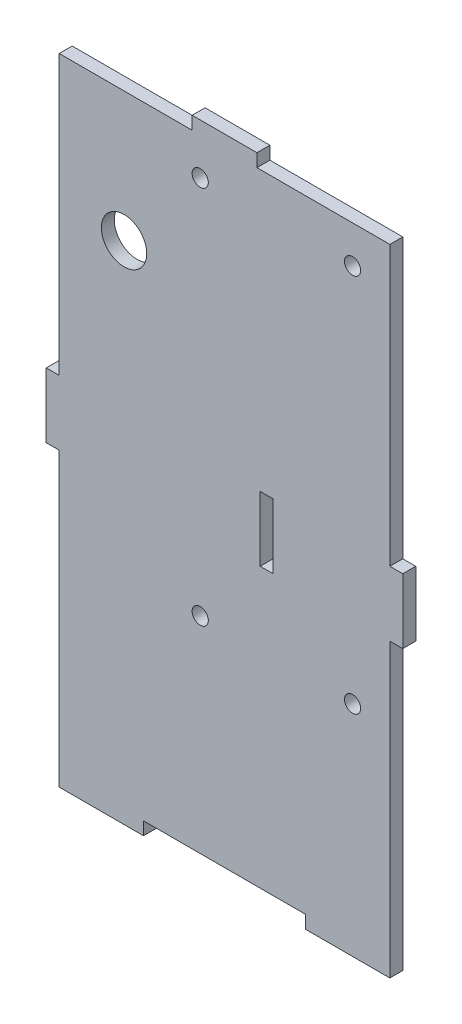
ISO-10303-21;
HEADER;
FILE_DESCRIPTION(('STEP AP214'),'2;1');
FILE_NAME('part.step','',(''),(''),'','','');
FILE_SCHEMA(('AUTOMOTIVE_DESIGN { 1 0 10303 214 1 1 1 1 }'));
ENDSEC;
DATA;
#1=APPLICATION_CONTEXT('core data for automotive mechanical design processes');
#2=APPLICATION_PROTOCOL_DEFINITION('international standard','automotive_design',2000,#1);
#3=PRODUCT_CONTEXT('',#1,'mechanical');
#4=PRODUCT('Part','Part','',(#3));
#5=PRODUCT_RELATED_PRODUCT_CATEGORY('part','',(#4));
#6=PRODUCT_DEFINITION_FORMATION('','',#4);
#7=PRODUCT_DEFINITION_CONTEXT('part definition',#1,'design');
#8=PRODUCT_DEFINITION('design','',#6,#7);
#9=PRODUCT_DEFINITION_SHAPE('','',#8);
#10=(LENGTH_UNIT() NAMED_UNIT(*) SI_UNIT(.MILLI.,.METRE.));
#11=(NAMED_UNIT(*) PLANE_ANGLE_UNIT() SI_UNIT($,.RADIAN.));
#12=(NAMED_UNIT(*) SI_UNIT($,.STERADIAN.) SOLID_ANGLE_UNIT());
#13=UNCERTAINTY_MEASURE_WITH_UNIT(LENGTH_MEASURE(1.E-05),#10,'distance_accuracy_value','');
#14=(GEOMETRIC_REPRESENTATION_CONTEXT(3) GLOBAL_UNCERTAINTY_ASSIGNED_CONTEXT((#13)) GLOBAL_UNIT_ASSIGNED_CONTEXT((#10,
#11,#12)) REPRESENTATION_CONTEXT('',''));
#15=CARTESIAN_POINT('',(0.,0.,0.));
#16=DIRECTION('',(0.,0.,1.));
#17=DIRECTION('',(1.,0.,0.));
#18=AXIS2_PLACEMENT_3D('',#15,#16,#17);
#19=CARTESIAN_POINT('',(0.,0.,2.));
#20=DIRECTION('',(0.,0.,-1.));
#21=DIRECTION('',(-1.,0.,0.));
#22=AXIS2_PLACEMENT_3D('',#19,#20,#21);
#23=PLANE('',#22);
#24=DIRECTION('',(-1.,0.,0.));
#25=VECTOR('',#24,1.);
#26=CARTESIAN_POINT('',(22.5,100.,2.));
#27=LINE('',#26,#25);
#28=CARTESIAN_POINT('',(32.5,100.,2.));
#29=VERTEX_POINT('',#28);
#30=CARTESIAN_POINT('',(22.5,100.,2.));
#31=VERTEX_POINT('',#30);
#32=EDGE_CURVE('E232',#29,#31,#27,.T.);
#33=ORIENTED_EDGE('',*,*,#32,.T.);
#34=DIRECTION('',(0.,-1.,0.));
#35=VECTOR('',#34,1.);
#36=CARTESIAN_POINT('',(22.5,100.,2.));
#37=LINE('',#36,#35);
#38=CARTESIAN_POINT('',(22.5,98.,2.));
#39=VERTEX_POINT('',#38);
#40=EDGE_CURVE('E235',#31,#39,#37,.T.);
#41=ORIENTED_EDGE('',*,*,#40,.T.);
#42=DIRECTION('',(-1.,0.,0.));
#43=VECTOR('',#42,1.);
#44=CARTESIAN_POINT('',(22.5,98.,2.));
#45=LINE('',#44,#43);
#46=CARTESIAN_POINT('',(1.99999999999999,98.,2.));
#47=VERTEX_POINT('',#46);
#48=EDGE_CURVE('E238',#39,#47,#45,.T.);
#49=ORIENTED_EDGE('',*,*,#48,.T.);
#50=DIRECTION('',(0.,-1.,0.));
#51=VECTOR('',#50,1.);
#52=CARTESIAN_POINT('',(1.99999999999999,98.,2.));
#53=LINE('',#52,#51);
#54=CARTESIAN_POINT('',(2.,55.,2.));
#55=VERTEX_POINT('',#54);
#56=EDGE_CURVE('E240',#47,#55,#53,.T.);
#57=ORIENTED_EDGE('',*,*,#56,.T.);
#58=DIRECTION('',(-1.,0.,0.));
#59=VECTOR('',#58,1.);
#60=CARTESIAN_POINT('',(2.,55.,2.));
#61=LINE('',#60,#59);
#62=CARTESIAN_POINT('',(0.,55.,2.));
#63=VERTEX_POINT('',#62);
#64=EDGE_CURVE('E242',#55,#63,#61,.T.);
#65=ORIENTED_EDGE('',*,*,#64,.T.);
#66=DIRECTION('',(0.,-1.,0.));
#67=VECTOR('',#66,1.);
#68=CARTESIAN_POINT('',(0.,55.,2.));
#69=LINE('',#68,#67);
#70=CARTESIAN_POINT('',(0.,45.,2.));
#71=VERTEX_POINT('',#70);
#72=EDGE_CURVE('E244',#63,#71,#69,.T.);
#73=ORIENTED_EDGE('',*,*,#72,.T.);
#74=DIRECTION('',(1.,0.,0.));
#75=VECTOR('',#74,1.);
#76=CARTESIAN_POINT('',(0.,45.,2.));
#77=LINE('',#76,#75);
#78=CARTESIAN_POINT('',(2.,45.,2.));
#79=VERTEX_POINT('',#78);
#80=EDGE_CURVE('E246',#71,#79,#77,.T.);
#81=ORIENTED_EDGE('',*,*,#80,.T.);
#82=DIRECTION('',(0.,-1.,0.));
#83=VECTOR('',#82,1.);
#84=CARTESIAN_POINT('',(2.,45.,2.));
#85=LINE('',#84,#83);
#86=CARTESIAN_POINT('',(2.00000000000001,0.,2.));
#87=VERTEX_POINT('',#86);
#88=EDGE_CURVE('E248',#79,#87,#85,.T.);
#89=ORIENTED_EDGE('',*,*,#88,.T.);
#90=DIRECTION('',(1.,0.,0.));
#91=VECTOR('',#90,1.);
#92=CARTESIAN_POINT('',(15.,0.,2.));
#93=LINE('',#92,#91);
#94=CARTESIAN_POINT('',(15.,0.,2.));
#95=VERTEX_POINT('',#94);
#96=EDGE_CURVE('E250',#87,#95,#93,.T.);
#97=ORIENTED_EDGE('',*,*,#96,.T.);
#98=DIRECTION('',(0.,1.,0.));
#99=VECTOR('',#98,1.);
#100=CARTESIAN_POINT('',(15.,2.,2.));
#101=LINE('',#100,#99);
#102=CARTESIAN_POINT('',(15.,2.,2.));
#103=VERTEX_POINT('',#102);
#104=EDGE_CURVE('E252',#95,#103,#101,.T.);
#105=ORIENTED_EDGE('',*,*,#104,.T.);
#106=DIRECTION('',(1.,0.,0.));
#107=VECTOR('',#106,1.);
#108=CARTESIAN_POINT('',(40.,2.,2.));
#109=LINE('',#108,#107);
#110=CARTESIAN_POINT('',(40.,2.,2.));
#111=VERTEX_POINT('',#110);
#112=EDGE_CURVE('E254',#103,#111,#109,.T.);
#113=ORIENTED_EDGE('',*,*,#112,.T.);
#114=DIRECTION('',(0.,-1.,0.));
#115=VECTOR('',#114,1.);
#116=CARTESIAN_POINT('',(40.,0.,2.));
#117=LINE('',#116,#115);
#118=CARTESIAN_POINT('',(40.,0.,2.));
#119=VERTEX_POINT('',#118);
#120=EDGE_CURVE('E256',#111,#119,#117,.T.);
#121=ORIENTED_EDGE('',*,*,#120,.T.);
#122=DIRECTION('',(1.,0.,0.));
#123=VECTOR('',#122,1.);
#124=CARTESIAN_POINT('',(53.,0.,2.));
#125=LINE('',#124,#123);
#126=CARTESIAN_POINT('',(53.,0.,2.));
#127=VERTEX_POINT('',#126);
#128=EDGE_CURVE('E258',#119,#127,#125,.T.);
#129=ORIENTED_EDGE('',*,*,#128,.T.);
#130=DIRECTION('',(0.,1.,0.));
#131=VECTOR('',#130,1.);
#132=CARTESIAN_POINT('',(53.,45.,2.));
#133=LINE('',#132,#131);
#134=CARTESIAN_POINT('',(53.,45.,2.));
#135=VERTEX_POINT('',#134);
#136=EDGE_CURVE('E260',#127,#135,#133,.T.);
#137=ORIENTED_EDGE('',*,*,#136,.T.);
#138=DIRECTION('',(1.,0.,0.));
#139=VECTOR('',#138,1.);
#140=CARTESIAN_POINT('',(55.,45.,2.));
#141=LINE('',#140,#139);
#142=CARTESIAN_POINT('',(55.,45.,2.));
#143=VERTEX_POINT('',#142);
#144=EDGE_CURVE('E262',#135,#143,#141,.T.);
#145=ORIENTED_EDGE('',*,*,#144,.T.);
#146=DIRECTION('',(0.,1.,0.));
#147=VECTOR('',#146,1.);
#148=CARTESIAN_POINT('',(55.,55.,2.));
#149=LINE('',#148,#147);
#150=CARTESIAN_POINT('',(55.,55.,2.));
#151=VERTEX_POINT('',#150);
#152=EDGE_CURVE('E264',#143,#151,#149,.T.);
#153=ORIENTED_EDGE('',*,*,#152,.T.);
#154=DIRECTION('',(-1.,0.,0.));
#155=VECTOR('',#154,1.);
#156=CARTESIAN_POINT('',(53.,55.,2.));
#157=LINE('',#156,#155);
#158=CARTESIAN_POINT('',(53.,55.,2.));
#159=VERTEX_POINT('',#158);
#160=EDGE_CURVE('E266',#151,#159,#157,.T.);
#161=ORIENTED_EDGE('',*,*,#160,.T.);
#162=DIRECTION('',(0.,1.,0.));
#163=VECTOR('',#162,1.);
#164=CARTESIAN_POINT('',(53.,98.,2.));
#165=LINE('',#164,#163);
#166=CARTESIAN_POINT('',(53.,98.,2.));
#167=VERTEX_POINT('',#166);
#168=EDGE_CURVE('E268',#159,#167,#165,.T.);
#169=ORIENTED_EDGE('',*,*,#168,.T.);
#170=DIRECTION('',(-1.,0.,0.));
#171=VECTOR('',#170,1.);
#172=CARTESIAN_POINT('',(32.5,98.,2.));
#173=LINE('',#172,#171);
#174=CARTESIAN_POINT('',(32.5,98.,2.));
#175=VERTEX_POINT('',#174);
#176=EDGE_CURVE('E270',#167,#175,#173,.T.);
#177=ORIENTED_EDGE('',*,*,#176,.T.);
#178=DIRECTION('',(0.,1.,0.));
#179=VECTOR('',#178,1.);
#180=CARTESIAN_POINT('',(32.5,100.,2.));
#181=LINE('',#180,#179);
#182=EDGE_CURVE('E272',#175,#29,#181,.T.);
#183=ORIENTED_EDGE('',*,*,#182,.T.);
#184=EDGE_LOOP('',(#33,#41,#49,#57,#65,#73,#81,#89,#97,#105,#113,#121,#129,#137,#145,#153,#161,
#169,#177,#183));
#185=FACE_BOUND('',#184,.T.);
#186=DIRECTION('',(0.,1.,0.));
#187=VECTOR('',#186,1.);
#188=CARTESIAN_POINT('',(35.,55.,2.));
#189=LINE('',#188,#187);
#190=CARTESIAN_POINT('',(35.,45.,2.));
#191=VERTEX_POINT('',#190);
#192=CARTESIAN_POINT('',(35.,55.,2.));
#193=VERTEX_POINT('',#192);
#194=EDGE_CURVE('E193',#191,#193,#189,.T.);
#195=ORIENTED_EDGE('',*,*,#194,.F.);
#196=DIRECTION('',(1.,0.,0.));
#197=VECTOR('',#196,1.);
#198=CARTESIAN_POINT('',(35.,45.,2.));
#199=LINE('',#198,#197);
#200=CARTESIAN_POINT('',(33.,45.,2.));
#201=VERTEX_POINT('',#200);
#202=EDGE_CURVE('E216',#201,#191,#199,.T.);
#203=ORIENTED_EDGE('',*,*,#202,.F.);
#204=DIRECTION('',(0.,-1.,0.));
#205=VECTOR('',#204,1.);
#206=CARTESIAN_POINT('',(33.,55.,2.));
#207=LINE('',#206,#205);
#208=CARTESIAN_POINT('',(33.,55.,2.));
#209=VERTEX_POINT('',#208);
#210=EDGE_CURVE('E214',#209,#201,#207,.T.);
#211=ORIENTED_EDGE('',*,*,#210,.F.);
#212=DIRECTION('',(-1.,0.,0.));
#213=VECTOR('',#212,1.);
#214=CARTESIAN_POINT('',(35.,55.,2.));
#215=LINE('',#214,#213);
#216=EDGE_CURVE('E201',#193,#209,#215,.T.);
#217=ORIENTED_EDGE('',*,*,#216,.F.);
#218=EDGE_LOOP('',(#195,#203,#211,#217));
#219=FACE_BOUND('',#218,.T.);
#220=CARTESIAN_POINT('',(47.25,92.25,2.));
#221=DIRECTION('',(0.,0.,1.));
#222=DIRECTION('',(1.,0.,0.));
#223=AXIS2_PLACEMENT_3D('',#220,#221,#222);
#224=CIRCLE('',#223,1.25);
#225=CARTESIAN_POINT('',(48.5,92.25,2.));
#226=VERTEX_POINT('',#225);
#227=EDGE_CURVE('E222',#226,#226,#224,.T.);
#228=ORIENTED_EDGE('',*,*,#227,.F.);
#229=EDGE_LOOP('',(#228));
#230=FACE_BOUND('',#229,.T.);
#231=CARTESIAN_POINT('',(23.75,92.25,2.));
#232=DIRECTION('',(0.,0.,1.));
#233=DIRECTION('',(-1.,0.,0.));
#234=AXIS2_PLACEMENT_3D('',#231,#232,#233);
#235=CIRCLE('',#234,1.25);
#236=CARTESIAN_POINT('',(22.5,92.25,2.));
#237=VERTEX_POINT('',#236);
#238=EDGE_CURVE('E752',#237,#237,#235,.T.);
#239=ORIENTED_EDGE('',*,*,#238,.F.);
#240=EDGE_LOOP('',(#239));
#241=FACE_BOUND('',#240,.T.);
#242=CARTESIAN_POINT('',(47.25,33.75,2.));
#243=DIRECTION('',(0.,0.,1.));
#244=DIRECTION('',(-1.,0.,0.));
#245=AXIS2_PLACEMENT_3D('',#242,#243,#244);
#246=CIRCLE('',#245,1.25);
#247=CARTESIAN_POINT('',(46.,33.75,2.));
#248=VERTEX_POINT('',#247);
#249=EDGE_CURVE('E746',#248,#248,#246,.T.);
#250=ORIENTED_EDGE('',*,*,#249,.F.);
#251=EDGE_LOOP('',(#250));
#252=FACE_BOUND('',#251,.T.);
#253=CARTESIAN_POINT('',(23.75,33.75,2.));
#254=DIRECTION('',(0.,0.,1.));
#255=DIRECTION('',(1.,0.,0.));
#256=AXIS2_PLACEMENT_3D('',#253,#254,#255);
#257=CIRCLE('',#256,1.25);
#258=CARTESIAN_POINT('',(25.,33.75,2.));
#259=VERTEX_POINT('',#258);
#260=EDGE_CURVE('E740',#259,#259,#257,.T.);
#261=ORIENTED_EDGE('',*,*,#260,.F.);
#262=EDGE_LOOP('',(#261));
#263=FACE_BOUND('',#262,.T.);
#264=CARTESIAN_POINT('',(12.,78.,2.));
#265=DIRECTION('',(0.,0.,1.));
#266=DIRECTION('',(1.,0.,0.));
#267=AXIS2_PLACEMENT_3D('',#264,#265,#266);
#268=CIRCLE('',#267,3.5);
#269=CARTESIAN_POINT('',(15.5,78.,2.));
#270=VERTEX_POINT('',#269);
#271=EDGE_CURVE('E731',#270,#270,#268,.T.);
#272=ORIENTED_EDGE('',*,*,#271,.F.);
#273=EDGE_LOOP('',(#272));
#274=FACE_BOUND('',#273,.T.);
#275=ADVANCED_FACE('F32',(#185,#219,#230,#241,#252,#263,#274),#23,.F.);
#276=CARTESIAN_POINT('',(0.,0.,0.));
#277=DIRECTION('',(0.,0.,-1.));
#278=DIRECTION('',(-1.,0.,0.));
#279=AXIS2_PLACEMENT_3D('',#276,#277,#278);
#280=PLANE('',#279);
#281=CARTESIAN_POINT('',(23.75,33.75,0.));
#282=DIRECTION('',(0.,0.,1.));
#283=DIRECTION('',(1.,0.,0.));
#284=AXIS2_PLACEMENT_3D('',#281,#282,#283);
#285=CIRCLE('',#284,1.25);
#286=CARTESIAN_POINT('',(25.,33.75,0.));
#287=VERTEX_POINT('',#286);
#288=EDGE_CURVE('E737',#287,#287,#285,.T.);
#289=ORIENTED_EDGE('',*,*,#288,.T.);
#290=EDGE_LOOP('',(#289));
#291=FACE_BOUND('',#290,.T.);
#292=CARTESIAN_POINT('',(23.75,92.25,0.));
#293=DIRECTION('',(0.,0.,1.));
#294=DIRECTION('',(-1.,0.,0.));
#295=AXIS2_PLACEMENT_3D('',#292,#293,#294);
#296=CIRCLE('',#295,1.25);
#297=CARTESIAN_POINT('',(22.5,92.25,0.));
#298=VERTEX_POINT('',#297);
#299=EDGE_CURVE('E749',#298,#298,#296,.T.);
#300=ORIENTED_EDGE('',*,*,#299,.T.);
#301=EDGE_LOOP('',(#300));
#302=FACE_BOUND('',#301,.T.);
#303=DIRECTION('',(1.,0.,0.));
#304=VECTOR('',#303,1.);
#305=CARTESIAN_POINT('',(35.,45.,0.));
#306=LINE('',#305,#304);
#307=CARTESIAN_POINT('',(33.,45.,0.));
#308=VERTEX_POINT('',#307);
#309=CARTESIAN_POINT('',(35.,45.,0.));
#310=VERTEX_POINT('',#309);
#311=EDGE_CURVE('E202',#308,#310,#306,.T.);
#312=ORIENTED_EDGE('',*,*,#311,.T.);
#313=DIRECTION('',(0.,1.,0.));
#314=VECTOR('',#313,1.);
#315=CARTESIAN_POINT('',(35.,55.,0.));
#316=LINE('',#315,#314);
#317=CARTESIAN_POINT('',(35.,55.,0.));
#318=VERTEX_POINT('',#317);
#319=EDGE_CURVE('E55',#310,#318,#316,.T.);
#320=ORIENTED_EDGE('',*,*,#319,.T.);
#321=DIRECTION('',(-1.,0.,0.));
#322=VECTOR('',#321,1.);
#323=CARTESIAN_POINT('',(35.,55.,0.));
#324=LINE('',#323,#322);
#325=CARTESIAN_POINT('',(33.,55.,0.));
#326=VERTEX_POINT('',#325);
#327=EDGE_CURVE('E208',#318,#326,#324,.T.);
#328=ORIENTED_EDGE('',*,*,#327,.T.);
#329=DIRECTION('',(0.,-1.,0.));
#330=VECTOR('',#329,1.);
#331=CARTESIAN_POINT('',(33.,55.,0.));
#332=LINE('',#331,#330);
#333=EDGE_CURVE('E224',#326,#308,#332,.T.);
#334=ORIENTED_EDGE('',*,*,#333,.T.);
#335=EDGE_LOOP('',(#312,#320,#328,#334));
#336=FACE_BOUND('',#335,.T.);
#337=DIRECTION('',(-1.,0.,0.));
#338=VECTOR('',#337,1.);
#339=CARTESIAN_POINT('',(22.5,100.,0.));
#340=LINE('',#339,#338);
#341=CARTESIAN_POINT('',(32.5,100.,0.));
#342=VERTEX_POINT('',#341);
#343=CARTESIAN_POINT('',(22.5,100.,0.));
#344=VERTEX_POINT('',#343);
#345=EDGE_CURVE('E209',#342,#344,#340,.T.);
#346=ORIENTED_EDGE('',*,*,#345,.F.);
#347=DIRECTION('',(0.,1.,0.));
#348=VECTOR('',#347,1.);
#349=CARTESIAN_POINT('',(32.5,100.,0.));
#350=LINE('',#349,#348);
#351=CARTESIAN_POINT('',(32.5,98.,0.));
#352=VERTEX_POINT('',#351);
#353=EDGE_CURVE('E236',#352,#342,#350,.T.);
#354=ORIENTED_EDGE('',*,*,#353,.F.);
#355=DIRECTION('',(-1.,0.,0.));
#356=VECTOR('',#355,1.);
#357=CARTESIAN_POINT('',(32.5,98.,0.));
#358=LINE('',#357,#356);
#359=CARTESIAN_POINT('',(53.,98.,0.));
#360=VERTEX_POINT('',#359);
#361=EDGE_CURVE('E311',#360,#352,#358,.T.);
#362=ORIENTED_EDGE('',*,*,#361,.F.);
#363=DIRECTION('',(0.,1.,0.));
#364=VECTOR('',#363,1.);
#365=CARTESIAN_POINT('',(53.,98.,0.));
#366=LINE('',#365,#364);
#367=CARTESIAN_POINT('',(53.,55.,0.));
#368=VERTEX_POINT('',#367);
#369=EDGE_CURVE('E309',#368,#360,#366,.T.);
#370=ORIENTED_EDGE('',*,*,#369,.F.);
#371=DIRECTION('',(-1.,0.,0.));
#372=VECTOR('',#371,1.);
#373=CARTESIAN_POINT('',(53.,55.,0.));
#374=LINE('',#373,#372);
#375=CARTESIAN_POINT('',(55.,55.,0.));
#376=VERTEX_POINT('',#375);
#377=EDGE_CURVE('E307',#376,#368,#374,.T.);
#378=ORIENTED_EDGE('',*,*,#377,.F.);
#379=DIRECTION('',(0.,1.,0.));
#380=VECTOR('',#379,1.);
#381=CARTESIAN_POINT('',(55.,55.,0.));
#382=LINE('',#381,#380);
#383=CARTESIAN_POINT('',(55.,45.,0.));
#384=VERTEX_POINT('',#383);
#385=EDGE_CURVE('E305',#384,#376,#382,.T.);
#386=ORIENTED_EDGE('',*,*,#385,.F.);
#387=DIRECTION('',(1.,0.,0.));
#388=VECTOR('',#387,1.);
#389=CARTESIAN_POINT('',(55.,45.,0.));
#390=LINE('',#389,#388);
#391=CARTESIAN_POINT('',(53.,45.,0.));
#392=VERTEX_POINT('',#391);
#393=EDGE_CURVE('E303',#392,#384,#390,.T.);
#394=ORIENTED_EDGE('',*,*,#393,.F.);
#395=DIRECTION('',(0.,1.,0.));
#396=VECTOR('',#395,1.);
#397=CARTESIAN_POINT('',(53.,45.,0.));
#398=LINE('',#397,#396);
#399=CARTESIAN_POINT('',(53.,0.,0.));
#400=VERTEX_POINT('',#399);
#401=EDGE_CURVE('E301',#400,#392,#398,.T.);
#402=ORIENTED_EDGE('',*,*,#401,.F.);
#403=DIRECTION('',(1.,0.,0.));
#404=VECTOR('',#403,1.);
#405=CARTESIAN_POINT('',(53.,0.,0.));
#406=LINE('',#405,#404);
#407=CARTESIAN_POINT('',(40.,0.,0.));
#408=VERTEX_POINT('',#407);
#409=EDGE_CURVE('E299',#408,#400,#406,.T.);
#410=ORIENTED_EDGE('',*,*,#409,.F.);
#411=DIRECTION('',(0.,-1.,0.));
#412=VECTOR('',#411,1.);
#413=CARTESIAN_POINT('',(40.,0.,0.));
#414=LINE('',#413,#412);
#415=CARTESIAN_POINT('',(40.,2.,0.));
#416=VERTEX_POINT('',#415);
#417=EDGE_CURVE('E297',#416,#408,#414,.T.);
#418=ORIENTED_EDGE('',*,*,#417,.F.);
#419=DIRECTION('',(1.,0.,0.));
#420=VECTOR('',#419,1.);
#421=CARTESIAN_POINT('',(40.,2.,0.));
#422=LINE('',#421,#420);
#423=CARTESIAN_POINT('',(15.,2.,0.));
#424=VERTEX_POINT('',#423);
#425=EDGE_CURVE('E295',#424,#416,#422,.T.);
#426=ORIENTED_EDGE('',*,*,#425,.F.);
#427=DIRECTION('',(0.,1.,0.));
#428=VECTOR('',#427,1.);
#429=CARTESIAN_POINT('',(15.,2.,0.));
#430=LINE('',#429,#428);
#431=CARTESIAN_POINT('',(15.,0.,0.));
#432=VERTEX_POINT('',#431);
#433=EDGE_CURVE('E293',#432,#424,#430,.T.);
#434=ORIENTED_EDGE('',*,*,#433,.F.);
#435=DIRECTION('',(1.,0.,0.));
#436=VECTOR('',#435,1.);
#437=CARTESIAN_POINT('',(15.,0.,0.));
#438=LINE('',#437,#436);
#439=CARTESIAN_POINT('',(2.00000000000001,0.,0.));
#440=VERTEX_POINT('',#439);
#441=EDGE_CURVE('E291',#440,#432,#438,.T.);
#442=ORIENTED_EDGE('',*,*,#441,.F.);
#443=DIRECTION('',(0.,-1.,0.));
#444=VECTOR('',#443,1.);
#445=CARTESIAN_POINT('',(2.,45.,0.));
#446=LINE('',#445,#444);
#447=CARTESIAN_POINT('',(2.,45.,0.));
#448=VERTEX_POINT('',#447);
#449=EDGE_CURVE('E289',#448,#440,#446,.T.);
#450=ORIENTED_EDGE('',*,*,#449,.F.);
#451=DIRECTION('',(1.,0.,0.));
#452=VECTOR('',#451,1.);
#453=CARTESIAN_POINT('',(0.,45.,0.));
#454=LINE('',#453,#452);
#455=CARTESIAN_POINT('',(0.,45.,0.));
#456=VERTEX_POINT('',#455);
#457=EDGE_CURVE('E287',#456,#448,#454,.T.);
#458=ORIENTED_EDGE('',*,*,#457,.F.);
#459=DIRECTION('',(0.,-1.,0.));
#460=VECTOR('',#459,1.);
#461=CARTESIAN_POINT('',(0.,55.,0.));
#462=LINE('',#461,#460);
#463=CARTESIAN_POINT('',(0.,55.,0.));
#464=VERTEX_POINT('',#463);
#465=EDGE_CURVE('E285',#464,#456,#462,.T.);
#466=ORIENTED_EDGE('',*,*,#465,.F.);
#467=DIRECTION('',(-1.,0.,0.));
#468=VECTOR('',#467,1.);
#469=CARTESIAN_POINT('',(2.,55.,0.));
#470=LINE('',#469,#468);
#471=CARTESIAN_POINT('',(2.,55.,0.));
#472=VERTEX_POINT('',#471);
#473=EDGE_CURVE('E283',#472,#464,#470,.T.);
#474=ORIENTED_EDGE('',*,*,#473,.F.);
#475=DIRECTION('',(0.,-1.,0.));
#476=VECTOR('',#475,1.);
#477=CARTESIAN_POINT('',(1.99999999999999,98.,0.));
#478=LINE('',#477,#476);
#479=CARTESIAN_POINT('',(1.99999999999999,98.,0.));
#480=VERTEX_POINT('',#479);
#481=EDGE_CURVE('E281',#480,#472,#478,.T.);
#482=ORIENTED_EDGE('',*,*,#481,.F.);
#483=DIRECTION('',(-1.,0.,0.));
#484=VECTOR('',#483,1.);
#485=CARTESIAN_POINT('',(22.5,98.,0.));
#486=LINE('',#485,#484);
#487=CARTESIAN_POINT('',(22.5,98.,0.));
#488=VERTEX_POINT('',#487);
#489=EDGE_CURVE('E279',#488,#480,#486,.T.);
#490=ORIENTED_EDGE('',*,*,#489,.F.);
#491=DIRECTION('',(0.,-1.,0.));
#492=VECTOR('',#491,1.);
#493=CARTESIAN_POINT('',(22.5,100.,0.));
#494=LINE('',#493,#492);
#495=EDGE_CURVE('E277',#344,#488,#494,.T.);
#496=ORIENTED_EDGE('',*,*,#495,.F.);
#497=EDGE_LOOP('',(#346,#354,#362,#370,#378,#386,#394,#402,#410,#418,#426,#434,#442,#450,#458,
#466,#474,#482,#490,#496));
#498=FACE_BOUND('',#497,.T.);
#499=CARTESIAN_POINT('',(47.25,92.25,0.));
#500=DIRECTION('',(0.,0.,1.));
#501=DIRECTION('',(1.,0.,0.));
#502=AXIS2_PLACEMENT_3D('',#499,#500,#501);
#503=CIRCLE('',#502,1.25);
#504=CARTESIAN_POINT('',(48.5,92.25,0.));
#505=VERTEX_POINT('',#504);
#506=EDGE_CURVE('E755',#505,#505,#503,.T.);
#507=ORIENTED_EDGE('',*,*,#506,.T.);
#508=EDGE_LOOP('',(#507));
#509=FACE_BOUND('',#508,.T.);
#510=CARTESIAN_POINT('',(47.25,33.75,0.));
#511=DIRECTION('',(0.,0.,1.));
#512=DIRECTION('',(-1.,0.,0.));
#513=AXIS2_PLACEMENT_3D('',#510,#511,#512);
#514=CIRCLE('',#513,1.25);
#515=CARTESIAN_POINT('',(46.,33.75,0.));
#516=VERTEX_POINT('',#515);
#517=EDGE_CURVE('E743',#516,#516,#514,.T.);
#518=ORIENTED_EDGE('',*,*,#517,.T.);
#519=EDGE_LOOP('',(#518));
#520=FACE_BOUND('',#519,.T.);
#521=CARTESIAN_POINT('',(12.,78.,0.));
#522=DIRECTION('',(0.,0.,1.));
#523=DIRECTION('',(1.,0.,0.));
#524=AXIS2_PLACEMENT_3D('',#521,#522,#523);
#525=CIRCLE('',#524,3.5);
#526=CARTESIAN_POINT('',(15.5,78.,0.));
#527=VERTEX_POINT('',#526);
#528=EDGE_CURVE('E734',#527,#527,#525,.T.);
#529=ORIENTED_EDGE('',*,*,#528,.T.);
#530=EDGE_LOOP('',(#529));
#531=FACE_BOUND('',#530,.T.);
#532=ADVANCED_FACE('F377',(#291,#302,#336,#498,#509,#520,#531),#280,.T.);
#533=CARTESIAN_POINT('',(22.5,100.,2.));
#534=DIRECTION('',(0.,-1.,0.));
#535=DIRECTION('',(0.,0.,-1.));
#536=AXIS2_PLACEMENT_3D('',#533,#534,#535);
#537=PLANE('',#536);
#538=ORIENTED_EDGE('',*,*,#345,.T.);
#539=DIRECTION('',(0.,0.,-1.));
#540=VECTOR('',#539,1.);
#541=CARTESIAN_POINT('',(22.5,100.,2.));
#542=LINE('',#541,#540);
#543=EDGE_CURVE('E11',#31,#344,#542,.T.);
#544=ORIENTED_EDGE('',*,*,#543,.F.);
#545=ORIENTED_EDGE('',*,*,#32,.F.);
#546=DIRECTION('',(0.,0.,-1.));
#547=VECTOR('',#546,1.);
#548=CARTESIAN_POINT('',(32.5,100.,2.));
#549=LINE('',#548,#547);
#550=EDGE_CURVE('E274',#29,#342,#549,.T.);
#551=ORIENTED_EDGE('',*,*,#550,.T.);
#552=EDGE_LOOP('',(#538,#544,#545,#551));
#553=FACE_BOUND('',#552,.T.);
#554=ADVANCED_FACE('F34',(#553),#537,.F.);
#555=CARTESIAN_POINT('',(22.5,100.,2.));
#556=DIRECTION('',(1.,0.,0.));
#557=DIRECTION('',(0.,0.,-1.));
#558=AXIS2_PLACEMENT_3D('',#555,#556,#557);
#559=PLANE('',#558);
#560=ORIENTED_EDGE('',*,*,#495,.T.);
#561=DIRECTION('',(0.,0.,-1.));
#562=VECTOR('',#561,1.);
#563=CARTESIAN_POINT('',(22.5,98.,2.));
#564=LINE('',#563,#562);
#565=EDGE_CURVE('E40',#39,#488,#564,.T.);
#566=ORIENTED_EDGE('',*,*,#565,.F.);
#567=ORIENTED_EDGE('',*,*,#40,.F.);
#568=ORIENTED_EDGE('',*,*,#543,.T.);
#569=EDGE_LOOP('',(#560,#566,#567,#568));
#570=FACE_BOUND('',#569,.T.);
#571=ADVANCED_FACE('F394',(#570),#559,.F.);
#572=CARTESIAN_POINT('',(22.5,98.,2.));
#573=DIRECTION('',(0.,-1.,0.));
#574=DIRECTION('',(0.,0.,-1.));
#575=AXIS2_PLACEMENT_3D('',#572,#573,#574);
#576=PLANE('',#575);
#577=ORIENTED_EDGE('',*,*,#489,.T.);
#578=DIRECTION('',(0.,0.,-1.));
#579=VECTOR('',#578,1.);
#580=CARTESIAN_POINT('',(1.99999999999999,98.,2.));
#581=LINE('',#580,#579);
#582=EDGE_CURVE('E364',#47,#480,#581,.T.);
#583=ORIENTED_EDGE('',*,*,#582,.F.);
#584=ORIENTED_EDGE('',*,*,#48,.F.);
#585=ORIENTED_EDGE('',*,*,#565,.T.);
#586=EDGE_LOOP('',(#577,#583,#584,#585));
#587=FACE_BOUND('',#586,.T.);
#588=ADVANCED_FACE('F371',(#587),#576,.F.);
#589=CARTESIAN_POINT('',(1.99999999999999,98.,2.));
#590=DIRECTION('',(1.,0.,0.));
#591=DIRECTION('',(0.,1.,0.));
#592=AXIS2_PLACEMENT_3D('',#589,#590,#591);
#593=PLANE('',#592);
#594=ORIENTED_EDGE('',*,*,#481,.T.);
#595=DIRECTION('',(0.,0.,-1.));
#596=VECTOR('',#595,1.);
#597=CARTESIAN_POINT('',(2.,55.,2.));
#598=LINE('',#597,#596);
#599=EDGE_CURVE('E361',#55,#472,#598,.T.);
#600=ORIENTED_EDGE('',*,*,#599,.F.);
#601=ORIENTED_EDGE('',*,*,#56,.F.);
#602=ORIENTED_EDGE('',*,*,#582,.T.);
#603=EDGE_LOOP('',(#594,#600,#601,#602));
#604=FACE_BOUND('',#603,.T.);
#605=ADVANCED_FACE('F383',(#604),#593,.F.);
#606=CARTESIAN_POINT('',(2.,55.,2.));
#607=DIRECTION('',(0.,-1.,0.));
#608=DIRECTION('',(1.,0.,0.));
#609=AXIS2_PLACEMENT_3D('',#606,#607,#608);
#610=PLANE('',#609);
#611=ORIENTED_EDGE('',*,*,#473,.T.);
#612=DIRECTION('',(0.,0.,-1.));
#613=VECTOR('',#612,1.);
#614=CARTESIAN_POINT('',(0.,55.,2.));
#615=LINE('',#614,#613);
#616=EDGE_CURVE('E358',#63,#464,#615,.T.);
#617=ORIENTED_EDGE('',*,*,#616,.F.);
#618=ORIENTED_EDGE('',*,*,#64,.F.);
#619=ORIENTED_EDGE('',*,*,#599,.T.);
#620=EDGE_LOOP('',(#611,#617,#618,#619));
#621=FACE_BOUND('',#620,.T.);
#622=ADVANCED_FACE('F387',(#621),#610,.F.);
#623=CARTESIAN_POINT('',(0.,55.,2.));
#624=DIRECTION('',(1.,0.,0.));
#625=DIRECTION('',(0.,1.,0.));
#626=AXIS2_PLACEMENT_3D('',#623,#624,#625);
#627=PLANE('',#626);
#628=ORIENTED_EDGE('',*,*,#465,.T.);
#629=DIRECTION('',(0.,0.,-1.));
#630=VECTOR('',#629,1.);
#631=CARTESIAN_POINT('',(0.,45.,2.));
#632=LINE('',#631,#630);
#633=EDGE_CURVE('E355',#71,#456,#632,.T.);
#634=ORIENTED_EDGE('',*,*,#633,.F.);
#635=ORIENTED_EDGE('',*,*,#72,.F.);
#636=ORIENTED_EDGE('',*,*,#616,.T.);
#637=EDGE_LOOP('',(#628,#634,#635,#636));
#638=FACE_BOUND('',#637,.T.);
#639=ADVANCED_FACE('F467',(#638),#627,.F.);
#640=CARTESIAN_POINT('',(0.,45.,2.));
#641=DIRECTION('',(0.,1.,0.));
#642=DIRECTION('',(0.,0.,1.));
#643=AXIS2_PLACEMENT_3D('',#640,#641,#642);
#644=PLANE('',#643);
#645=ORIENTED_EDGE('',*,*,#457,.T.);
#646=DIRECTION('',(0.,0.,-1.));
#647=VECTOR('',#646,1.);
#648=CARTESIAN_POINT('',(2.,45.,2.));
#649=LINE('',#648,#647);
#650=EDGE_CURVE('E352',#79,#448,#649,.T.);
#651=ORIENTED_EDGE('',*,*,#650,.F.);
#652=ORIENTED_EDGE('',*,*,#80,.F.);
#653=ORIENTED_EDGE('',*,*,#633,.T.);
#654=EDGE_LOOP('',(#645,#651,#652,#653));
#655=FACE_BOUND('',#654,.T.);
#656=ADVANCED_FACE('F465',(#655),#644,.F.);
#657=CARTESIAN_POINT('',(2.,45.,2.));
#658=DIRECTION('',(1.,0.,0.));
#659=DIRECTION('',(0.,1.,0.));
#660=AXIS2_PLACEMENT_3D('',#657,#658,#659);
#661=PLANE('',#660);
#662=ORIENTED_EDGE('',*,*,#449,.T.);
#663=DIRECTION('',(0.,0.,-1.));
#664=VECTOR('',#663,1.);
#665=CARTESIAN_POINT('',(2.00000000000001,0.,2.));
#666=LINE('',#665,#664);
#667=EDGE_CURVE('E349',#87,#440,#666,.T.);
#668=ORIENTED_EDGE('',*,*,#667,.F.);
#669=ORIENTED_EDGE('',*,*,#88,.F.);
#670=ORIENTED_EDGE('',*,*,#650,.T.);
#671=EDGE_LOOP('',(#662,#668,#669,#670));
#672=FACE_BOUND('',#671,.T.);
#673=ADVANCED_FACE('F460',(#672),#661,.F.);
#674=CARTESIAN_POINT('',(15.,0.,2.));
#675=DIRECTION('',(0.,1.,0.));
#676=DIRECTION('',(-1.,0.,0.));
#677=AXIS2_PLACEMENT_3D('',#674,#675,#676);
#678=PLANE('',#677);
#679=ORIENTED_EDGE('',*,*,#441,.T.);
#680=DIRECTION('',(0.,0.,-1.));
#681=VECTOR('',#680,1.);
#682=CARTESIAN_POINT('',(15.,0.,2.));
#683=LINE('',#682,#681);
#684=EDGE_CURVE('E346',#95,#432,#683,.T.);
#685=ORIENTED_EDGE('',*,*,#684,.F.);
#686=ORIENTED_EDGE('',*,*,#96,.F.);
#687=ORIENTED_EDGE('',*,*,#667,.T.);
#688=EDGE_LOOP('',(#679,#685,#686,#687));
#689=FACE_BOUND('',#688,.T.);
#690=ADVANCED_FACE('F455',(#689),#678,.F.);
#691=CARTESIAN_POINT('',(15.,2.,2.));
#692=DIRECTION('',(-1.,0.,0.));
#693=DIRECTION('',(0.,0.,1.));
#694=AXIS2_PLACEMENT_3D('',#691,#692,#693);
#695=PLANE('',#694);
#696=ORIENTED_EDGE('',*,*,#433,.T.);
#697=DIRECTION('',(0.,0.,-1.));
#698=VECTOR('',#697,1.);
#699=CARTESIAN_POINT('',(15.,2.,2.));
#700=LINE('',#699,#698);
#701=EDGE_CURVE('E343',#103,#424,#700,.T.);
#702=ORIENTED_EDGE('',*,*,#701,.F.);
#703=ORIENTED_EDGE('',*,*,#104,.F.);
#704=ORIENTED_EDGE('',*,*,#684,.T.);
#705=EDGE_LOOP('',(#696,#702,#703,#704));
#706=FACE_BOUND('',#705,.T.);
#707=ADVANCED_FACE('F451',(#706),#695,.F.);
#708=CARTESIAN_POINT('',(40.,2.,2.));
#709=DIRECTION('',(0.,1.,0.));
#710=DIRECTION('',(-1.,0.,0.));
#711=AXIS2_PLACEMENT_3D('',#708,#709,#710);
#712=PLANE('',#711);
#713=ORIENTED_EDGE('',*,*,#425,.T.);
#714=DIRECTION('',(0.,0.,-1.));
#715=VECTOR('',#714,1.);
#716=CARTESIAN_POINT('',(40.,2.,2.));
#717=LINE('',#716,#715);
#718=EDGE_CURVE('E340',#111,#416,#717,.T.);
#719=ORIENTED_EDGE('',*,*,#718,.F.);
#720=ORIENTED_EDGE('',*,*,#112,.F.);
#721=ORIENTED_EDGE('',*,*,#701,.T.);
#722=EDGE_LOOP('',(#713,#719,#720,#721));
#723=FACE_BOUND('',#722,.T.);
#724=ADVANCED_FACE('F446',(#723),#712,.F.);
#725=CARTESIAN_POINT('',(40.,0.,2.));
#726=DIRECTION('',(1.,0.,0.));
#727=DIRECTION('',(0.,0.,-1.));
#728=AXIS2_PLACEMENT_3D('',#725,#726,#727);
#729=PLANE('',#728);
#730=ORIENTED_EDGE('',*,*,#417,.T.);
#731=DIRECTION('',(0.,0.,-1.));
#732=VECTOR('',#731,1.);
#733=CARTESIAN_POINT('',(40.,0.,2.));
#734=LINE('',#733,#732);
#735=EDGE_CURVE('E337',#119,#408,#734,.T.);
#736=ORIENTED_EDGE('',*,*,#735,.F.);
#737=ORIENTED_EDGE('',*,*,#120,.F.);
#738=ORIENTED_EDGE('',*,*,#718,.T.);
#739=EDGE_LOOP('',(#730,#736,#737,#738));
#740=FACE_BOUND('',#739,.T.);
#741=ADVANCED_FACE('F440',(#740),#729,.F.);
#742=CARTESIAN_POINT('',(53.,0.,2.));
#743=DIRECTION('',(0.,1.,0.));
#744=DIRECTION('',(-1.,0.,0.));
#745=AXIS2_PLACEMENT_3D('',#742,#743,#744);
#746=PLANE('',#745);
#747=ORIENTED_EDGE('',*,*,#409,.T.);
#748=DIRECTION('',(0.,0.,-1.));
#749=VECTOR('',#748,1.);
#750=CARTESIAN_POINT('',(53.,0.,2.));
#751=LINE('',#750,#749);
#752=EDGE_CURVE('E334',#127,#400,#751,.T.);
#753=ORIENTED_EDGE('',*,*,#752,.F.);
#754=ORIENTED_EDGE('',*,*,#128,.F.);
#755=ORIENTED_EDGE('',*,*,#735,.T.);
#756=EDGE_LOOP('',(#747,#753,#754,#755));
#757=FACE_BOUND('',#756,.T.);
#758=ADVANCED_FACE('F436',(#757),#746,.F.);
#759=CARTESIAN_POINT('',(53.,45.,2.));
#760=DIRECTION('',(-1.,0.,0.));
#761=DIRECTION('',(0.,-1.,0.));
#762=AXIS2_PLACEMENT_3D('',#759,#760,#761);
#763=PLANE('',#762);
#764=ORIENTED_EDGE('',*,*,#401,.T.);
#765=DIRECTION('',(0.,0.,-1.));
#766=VECTOR('',#765,1.);
#767=CARTESIAN_POINT('',(53.,45.,2.));
#768=LINE('',#767,#766);
#769=EDGE_CURVE('E331',#135,#392,#768,.T.);
#770=ORIENTED_EDGE('',*,*,#769,.F.);
#771=ORIENTED_EDGE('',*,*,#136,.F.);
#772=ORIENTED_EDGE('',*,*,#752,.T.);
#773=EDGE_LOOP('',(#764,#770,#771,#772));
#774=FACE_BOUND('',#773,.T.);
#775=ADVANCED_FACE('F431',(#774),#763,.F.);
#776=CARTESIAN_POINT('',(55.,45.,2.));
#777=DIRECTION('',(0.,1.,0.));
#778=DIRECTION('',(0.,0.,1.));
#779=AXIS2_PLACEMENT_3D('',#776,#777,#778);
#780=PLANE('',#779);
#781=ORIENTED_EDGE('',*,*,#393,.T.);
#782=DIRECTION('',(0.,0.,-1.));
#783=VECTOR('',#782,1.);
#784=CARTESIAN_POINT('',(55.,45.,2.));
#785=LINE('',#784,#783);
#786=EDGE_CURVE('E328',#143,#384,#785,.T.);
#787=ORIENTED_EDGE('',*,*,#786,.F.);
#788=ORIENTED_EDGE('',*,*,#144,.F.);
#789=ORIENTED_EDGE('',*,*,#769,.T.);
#790=EDGE_LOOP('',(#781,#787,#788,#789));
#791=FACE_BOUND('',#790,.T.);
#792=ADVANCED_FACE('F425',(#791),#780,.F.);
#793=CARTESIAN_POINT('',(55.,55.,2.));
#794=DIRECTION('',(-1.,0.,0.));
#795=DIRECTION('',(0.,0.,1.));
#796=AXIS2_PLACEMENT_3D('',#793,#794,#795);
#797=PLANE('',#796);
#798=ORIENTED_EDGE('',*,*,#385,.T.);
#799=DIRECTION('',(0.,0.,-1.));
#800=VECTOR('',#799,1.);
#801=CARTESIAN_POINT('',(55.,55.,2.));
#802=LINE('',#801,#800);
#803=EDGE_CURVE('E325',#151,#376,#802,.T.);
#804=ORIENTED_EDGE('',*,*,#803,.F.);
#805=ORIENTED_EDGE('',*,*,#152,.F.);
#806=ORIENTED_EDGE('',*,*,#786,.T.);
#807=EDGE_LOOP('',(#798,#804,#805,#806));
#808=FACE_BOUND('',#807,.T.);
#809=ADVANCED_FACE('F421',(#808),#797,.F.);
#810=CARTESIAN_POINT('',(53.,55.,2.));
#811=DIRECTION('',(0.,-1.,0.));
#812=DIRECTION('',(0.,0.,-1.));
#813=AXIS2_PLACEMENT_3D('',#810,#811,#812);
#814=PLANE('',#813);
#815=ORIENTED_EDGE('',*,*,#377,.T.);
#816=DIRECTION('',(0.,0.,-1.));
#817=VECTOR('',#816,1.);
#818=CARTESIAN_POINT('',(53.,55.,2.));
#819=LINE('',#818,#817);
#820=EDGE_CURVE('E322',#159,#368,#819,.T.);
#821=ORIENTED_EDGE('',*,*,#820,.F.);
#822=ORIENTED_EDGE('',*,*,#160,.F.);
#823=ORIENTED_EDGE('',*,*,#803,.T.);
#824=EDGE_LOOP('',(#815,#821,#822,#823));
#825=FACE_BOUND('',#824,.T.);
#826=ADVANCED_FACE('F416',(#825),#814,.F.);
#827=CARTESIAN_POINT('',(53.,98.,2.));
#828=DIRECTION('',(-1.,0.,0.));
#829=DIRECTION('',(0.,-1.,0.));
#830=AXIS2_PLACEMENT_3D('',#827,#828,#829);
#831=PLANE('',#830);
#832=ORIENTED_EDGE('',*,*,#369,.T.);
#833=DIRECTION('',(0.,0.,-1.));
#834=VECTOR('',#833,1.);
#835=CARTESIAN_POINT('',(53.,98.,2.));
#836=LINE('',#835,#834);
#837=EDGE_CURVE('E319',#167,#360,#836,.T.);
#838=ORIENTED_EDGE('',*,*,#837,.F.);
#839=ORIENTED_EDGE('',*,*,#168,.F.);
#840=ORIENTED_EDGE('',*,*,#820,.T.);
#841=EDGE_LOOP('',(#832,#838,#839,#840));
#842=FACE_BOUND('',#841,.T.);
#843=ADVANCED_FACE('F410',(#842),#831,.F.);
#844=CARTESIAN_POINT('',(32.5,98.,2.));
#845=DIRECTION('',(0.,-1.,0.));
#846=DIRECTION('',(0.,0.,-1.));
#847=AXIS2_PLACEMENT_3D('',#844,#845,#846);
#848=PLANE('',#847);
#849=ORIENTED_EDGE('',*,*,#361,.T.);
#850=DIRECTION('',(0.,0.,-1.));
#851=VECTOR('',#850,1.);
#852=CARTESIAN_POINT('',(32.5,98.,2.));
#853=LINE('',#852,#851);
#854=EDGE_CURVE('E316',#175,#352,#853,.T.);
#855=ORIENTED_EDGE('',*,*,#854,.F.);
#856=ORIENTED_EDGE('',*,*,#176,.F.);
#857=ORIENTED_EDGE('',*,*,#837,.T.);
#858=EDGE_LOOP('',(#849,#855,#856,#857));
#859=FACE_BOUND('',#858,.T.);
#860=ADVANCED_FACE('F406',(#859),#848,.F.);
#861=CARTESIAN_POINT('',(32.5,100.,2.));
#862=DIRECTION('',(-1.,0.,0.));
#863=DIRECTION('',(0.,0.,1.));
#864=AXIS2_PLACEMENT_3D('',#861,#862,#863);
#865=PLANE('',#864);
#866=ORIENTED_EDGE('',*,*,#353,.T.);
#867=ORIENTED_EDGE('',*,*,#550,.F.);
#868=ORIENTED_EDGE('',*,*,#182,.F.);
#869=ORIENTED_EDGE('',*,*,#854,.T.);
#870=EDGE_LOOP('',(#866,#867,#868,#869));
#871=FACE_BOUND('',#870,.T.);
#872=ADVANCED_FACE('F401',(#871),#865,.F.);
#873=CARTESIAN_POINT('',(35.,55.,2.));
#874=DIRECTION('',(-1.,0.,0.));
#875=DIRECTION('',(0.,0.,1.));
#876=AXIS2_PLACEMENT_3D('',#873,#874,#875);
#877=PLANE('',#876);
#878=ORIENTED_EDGE('',*,*,#319,.F.);
#879=DIRECTION('',(0.,0.,-1.));
#880=VECTOR('',#879,1.);
#881=CARTESIAN_POINT('',(35.,45.,2.));
#882=LINE('',#881,#880);
#883=EDGE_CURVE('E197',#191,#310,#882,.T.);
#884=ORIENTED_EDGE('',*,*,#883,.F.);
#885=ORIENTED_EDGE('',*,*,#194,.T.);
#886=DIRECTION('',(0.,0.,-1.));
#887=VECTOR('',#886,1.);
#888=CARTESIAN_POINT('',(35.,55.,2.));
#889=LINE('',#888,#887);
#890=EDGE_CURVE('E196',#193,#318,#889,.T.);
#891=ORIENTED_EDGE('',*,*,#890,.T.);
#892=EDGE_LOOP('',(#878,#884,#885,#891));
#893=FACE_BOUND('',#892,.T.);
#894=ADVANCED_FACE('F195',(#893),#877,.T.);
#895=CARTESIAN_POINT('',(35.,55.,2.));
#896=DIRECTION('',(0.,-1.,0.));
#897=DIRECTION('',(0.,0.,-1.));
#898=AXIS2_PLACEMENT_3D('',#895,#896,#897);
#899=PLANE('',#898);
#900=ORIENTED_EDGE('',*,*,#327,.F.);
#901=ORIENTED_EDGE('',*,*,#890,.F.);
#902=ORIENTED_EDGE('',*,*,#216,.T.);
#903=DIRECTION('',(0.,0.,-1.));
#904=VECTOR('',#903,1.);
#905=CARTESIAN_POINT('',(33.,55.,2.));
#906=LINE('',#905,#904);
#907=EDGE_CURVE('E210',#209,#326,#906,.T.);
#908=ORIENTED_EDGE('',*,*,#907,.T.);
#909=EDGE_LOOP('',(#900,#901,#902,#908));
#910=FACE_BOUND('',#909,.T.);
#911=ADVANCED_FACE('F205',(#910),#899,.T.);
#912=CARTESIAN_POINT('',(33.,55.,2.));
#913=DIRECTION('',(1.,0.,0.));
#914=DIRECTION('',(0.,0.,-1.));
#915=AXIS2_PLACEMENT_3D('',#912,#913,#914);
#916=PLANE('',#915);
#917=ORIENTED_EDGE('',*,*,#333,.F.);
#918=ORIENTED_EDGE('',*,*,#907,.F.);
#919=ORIENTED_EDGE('',*,*,#210,.T.);
#920=DIRECTION('',(0.,0.,-1.));
#921=VECTOR('',#920,1.);
#922=CARTESIAN_POINT('',(33.,45.,2.));
#923=LINE('',#922,#921);
#924=EDGE_CURVE('E47',#201,#308,#923,.T.);
#925=ORIENTED_EDGE('',*,*,#924,.T.);
#926=EDGE_LOOP('',(#917,#918,#919,#925));
#927=FACE_BOUND('',#926,.T.);
#928=ADVANCED_FACE('F574',(#927),#916,.T.);
#929=CARTESIAN_POINT('',(35.,45.,2.));
#930=DIRECTION('',(0.,1.,0.));
#931=DIRECTION('',(0.,0.,1.));
#932=AXIS2_PLACEMENT_3D('',#929,#930,#931);
#933=PLANE('',#932);
#934=ORIENTED_EDGE('',*,*,#311,.F.);
#935=ORIENTED_EDGE('',*,*,#924,.F.);
#936=ORIENTED_EDGE('',*,*,#202,.T.);
#937=ORIENTED_EDGE('',*,*,#883,.T.);
#938=EDGE_LOOP('',(#934,#935,#936,#937));
#939=FACE_BOUND('',#938,.T.);
#940=ADVANCED_FACE('F580',(#939),#933,.T.);
#941=CARTESIAN_POINT('',(47.25,92.25,2.));
#942=DIRECTION('',(0.,0.,-1.));
#943=DIRECTION('',(-1.,0.,0.));
#944=AXIS2_PLACEMENT_3D('',#941,#942,#943);
#945=CYLINDRICAL_SURFACE('',#944,1.25);
#946=ORIENTED_EDGE('',*,*,#227,.T.);
#947=EDGE_LOOP('',(#946));
#948=FACE_BOUND('',#947,.T.);
#949=ORIENTED_EDGE('',*,*,#506,.F.);
#950=EDGE_LOOP('',(#949));
#951=FACE_BOUND('',#950,.T.);
#952=ADVANCED_FACE('F588',(#948,#951),#945,.F.);
#953=CARTESIAN_POINT('',(23.75,92.25,2.));
#954=DIRECTION('',(0.,0.,-1.));
#955=DIRECTION('',(-1.,0.,0.));
#956=AXIS2_PLACEMENT_3D('',#953,#954,#955);
#957=CYLINDRICAL_SURFACE('',#956,1.25);
#958=ORIENTED_EDGE('',*,*,#238,.T.);
#959=EDGE_LOOP('',(#958));
#960=FACE_BOUND('',#959,.T.);
#961=ORIENTED_EDGE('',*,*,#299,.F.);
#962=EDGE_LOOP('',(#961));
#963=FACE_BOUND('',#962,.T.);
#964=ADVANCED_FACE('F595',(#960,#963),#957,.F.);
#965=CARTESIAN_POINT('',(47.25,33.75,2.));
#966=DIRECTION('',(0.,0.,-1.));
#967=DIRECTION('',(-1.,0.,0.));
#968=AXIS2_PLACEMENT_3D('',#965,#966,#967);
#969=CYLINDRICAL_SURFACE('',#968,1.25);
#970=ORIENTED_EDGE('',*,*,#249,.T.);
#971=EDGE_LOOP('',(#970));
#972=FACE_BOUND('',#971,.T.);
#973=ORIENTED_EDGE('',*,*,#517,.F.);
#974=EDGE_LOOP('',(#973));
#975=FACE_BOUND('',#974,.T.);
#976=ADVANCED_FACE('F603',(#972,#975),#969,.F.);
#977=CARTESIAN_POINT('',(23.75,33.75,2.));
#978=DIRECTION('',(0.,0.,-1.));
#979=DIRECTION('',(-1.,0.,0.));
#980=AXIS2_PLACEMENT_3D('',#977,#978,#979);
#981=CYLINDRICAL_SURFACE('',#980,1.25);
#982=ORIENTED_EDGE('',*,*,#260,.T.);
#983=EDGE_LOOP('',(#982));
#984=FACE_BOUND('',#983,.T.);
#985=ORIENTED_EDGE('',*,*,#288,.F.);
#986=EDGE_LOOP('',(#985));
#987=FACE_BOUND('',#986,.T.);
#988=ADVANCED_FACE('F611',(#984,#987),#981,.F.);
#989=CARTESIAN_POINT('',(12.,78.,2.));
#990=DIRECTION('',(0.,0.,-1.));
#991=DIRECTION('',(-1.,0.,0.));
#992=AXIS2_PLACEMENT_3D('',#989,#990,#991);
#993=CYLINDRICAL_SURFACE('',#992,3.5);
#994=ORIENTED_EDGE('',*,*,#271,.T.);
#995=EDGE_LOOP('',(#994));
#996=FACE_BOUND('',#995,.T.);
#997=ORIENTED_EDGE('',*,*,#528,.F.);
#998=EDGE_LOOP('',(#997));
#999=FACE_BOUND('',#998,.T.);
#1000=ADVANCED_FACE('F619',(#996,#999),#993,.F.);
#1001=CLOSED_SHELL('',(#275,#532,#554,#571,#588,#605,#622,#639,#656,#673,#690,#707,#724,#741,
#758,#775,#792,#809,#826,#843,#860,#872,#894,#911,#928,#940,#952,#964,#976,#988,#1000));
#1002=MANIFOLD_SOLID_BREP('B2',#1001);
#1003=ADVANCED_BREP_SHAPE_REPRESENTATION('',(#18,#1002),#14);
#1004=SHAPE_DEFINITION_REPRESENTATION(#9,#1003);
ENDSEC;
END-ISO-10303-21;
